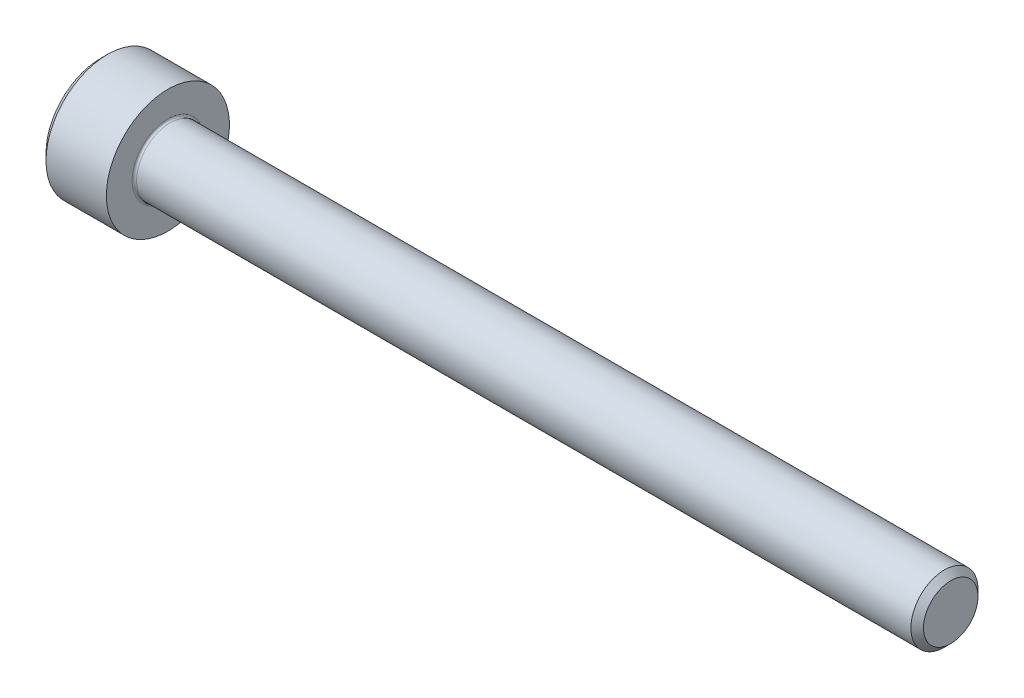
ISO-10303-21;
HEADER;
FILE_DESCRIPTION(('STEP AP214'),'2;1');
FILE_NAME('part.step','',(''),(''),'','','');
FILE_SCHEMA(('AUTOMOTIVE_DESIGN { 1 0 10303 214 1 1 1 1 }'));
ENDSEC;
DATA;
#1=APPLICATION_CONTEXT('core data for automotive mechanical design processes');
#2=APPLICATION_PROTOCOL_DEFINITION('international standard','automotive_design',2000,#1);
#3=PRODUCT_CONTEXT('',#1,'mechanical');
#4=PRODUCT('Part','Part','',(#3));
#5=PRODUCT_RELATED_PRODUCT_CATEGORY('part','',(#4));
#6=PRODUCT_DEFINITION_FORMATION('','',#4);
#7=PRODUCT_DEFINITION_CONTEXT('part definition',#1,'design');
#8=PRODUCT_DEFINITION('design','',#6,#7);
#9=PRODUCT_DEFINITION_SHAPE('','',#8);
#10=(LENGTH_UNIT() NAMED_UNIT(*) SI_UNIT(.MILLI.,.METRE.));
#11=(NAMED_UNIT(*) PLANE_ANGLE_UNIT() SI_UNIT($,.RADIAN.));
#12=(NAMED_UNIT(*) SI_UNIT($,.STERADIAN.) SOLID_ANGLE_UNIT());
#13=UNCERTAINTY_MEASURE_WITH_UNIT(LENGTH_MEASURE(1.E-05),#10,'distance_accuracy_value','');
#14=(GEOMETRIC_REPRESENTATION_CONTEXT(3) GLOBAL_UNCERTAINTY_ASSIGNED_CONTEXT((#13)) GLOBAL_UNIT_ASSIGNED_CONTEXT((#10,
#11,#12)) REPRESENTATION_CONTEXT('',''));
#15=CARTESIAN_POINT('',(0.,0.,0.));
#16=DIRECTION('',(0.,0.,1.));
#17=DIRECTION('',(1.,0.,0.));
#18=AXIS2_PLACEMENT_3D('',#15,#16,#17);
#19=CARTESIAN_POINT('',(0.,0.,0.));
#20=DIRECTION('',(-1.,0.,0.));
#21=DIRECTION('',(0.,0.,1.));
#22=AXIS2_PLACEMENT_3D('',#19,#20,#21);
#23=PLANE('',#22);
#24=DIRECTION('',(0.,-0.5,0.866025403784439));
#25=VECTOR('',#24,1.);
#26=CARTESIAN_POINT('',(0.,1.47801668912544,0.));
#27=LINE('',#26,#25);
#28=CARTESIAN_POINT('',(0.,1.47801668912544,0.));
#29=VERTEX_POINT('',#28);
#30=CARTESIAN_POINT('',(0.,0.739008344562719,1.28));
#31=VERTEX_POINT('',#30);
#32=EDGE_CURVE('E260',#29,#31,#27,.T.);
#33=ORIENTED_EDGE('',*,*,#32,.T.);
#34=DIRECTION('',(0.,1.,0.));
#35=VECTOR('',#34,1.);
#36=CARTESIAN_POINT('',(0.,-0.739008344562723,1.28));
#37=LINE('',#36,#35);
#38=CARTESIAN_POINT('',(0.,-0.739008344562723,1.28));
#39=VERTEX_POINT('',#38);
#40=EDGE_CURVE('E131',#39,#31,#37,.T.);
#41=ORIENTED_EDGE('',*,*,#40,.F.);
#42=DIRECTION('',(0.,-0.500000000000001,-0.866025403784438));
#43=VECTOR('',#42,1.);
#44=CARTESIAN_POINT('',(0.,-0.739008344562723,1.28));
#45=LINE('',#44,#43);
#46=CARTESIAN_POINT('',(0.,-1.47801668912545,0.));
#47=VERTEX_POINT('',#46);
#48=EDGE_CURVE('E263',#39,#47,#45,.T.);
#49=ORIENTED_EDGE('',*,*,#48,.T.);
#50=DIRECTION('',(0.,0.5,-0.866025403784439));
#51=VECTOR('',#50,1.);
#52=CARTESIAN_POINT('',(0.,-1.47801668912545,0.));
#53=LINE('',#52,#51);
#54=CARTESIAN_POINT('',(0.,-0.739008344562725,-1.28));
#55=VERTEX_POINT('',#54);
#56=EDGE_CURVE('E266',#47,#55,#53,.T.);
#57=ORIENTED_EDGE('',*,*,#56,.T.);
#58=DIRECTION('',(0.,-1.,0.));
#59=VECTOR('',#58,1.);
#60=CARTESIAN_POINT('',(0.,0.739008344562717,-1.28));
#61=LINE('',#60,#59);
#62=CARTESIAN_POINT('',(0.,0.739008344562717,-1.28));
#63=VERTEX_POINT('',#62);
#64=EDGE_CURVE('E269',#63,#55,#61,.T.);
#65=ORIENTED_EDGE('',*,*,#64,.F.);
#66=DIRECTION('',(0.,-0.500000000000001,-0.866025403784438));
#67=VECTOR('',#66,1.);
#68=CARTESIAN_POINT('',(0.,1.47801668912544,0.));
#69=LINE('',#68,#67);
#70=EDGE_CURVE('E126',#29,#63,#69,.T.);
#71=ORIENTED_EDGE('',*,*,#70,.F.);
#72=EDGE_LOOP('',(#33,#41,#49,#57,#65,#71));
#73=FACE_BOUND('',#72,.T.);
#74=CARTESIAN_POINT('',(0.,0.,0.));
#75=DIRECTION('',(-1.,0.,0.));
#76=DIRECTION('',(0.,0.,1.));
#77=AXIS2_PLACEMENT_3D('',#74,#75,#76);
#78=CIRCLE('',#77,2.45);
#79=CARTESIAN_POINT('',(0.,0.,2.45));
#80=VERTEX_POINT('',#79);
#81=EDGE_CURVE('E155',#80,#80,#78,.T.);
#82=ORIENTED_EDGE('',*,*,#81,.T.);
#83=EDGE_LOOP('',(#82));
#84=FACE_BOUND('',#83,.T.);
#85=ADVANCED_FACE('F35',(#73,#84),#23,.T.);
#86=CARTESIAN_POINT('',(0.,0.,0.));
#87=DIRECTION('',(1.,0.,0.));
#88=DIRECTION('',(0.,0.,-1.));
#89=AXIS2_PLACEMENT_3D('',#86,#87,#88);
#90=CONICAL_SURFACE('',#89,2.45,0.785398163397447);
#91=CARTESIAN_POINT('',(0.300000000000002,0.,0.));
#92=DIRECTION('',(-1.,0.,0.));
#93=DIRECTION('',(0.,0.,1.));
#94=AXIS2_PLACEMENT_3D('',#91,#92,#93);
#95=CIRCLE('',#94,2.75);
#96=CARTESIAN_POINT('',(0.300000000000002,0.,2.75));
#97=VERTEX_POINT('',#96);
#98=EDGE_CURVE('E152',#97,#97,#95,.T.);
#99=ORIENTED_EDGE('',*,*,#98,.T.);
#100=EDGE_LOOP('',(#99));
#101=FACE_BOUND('',#100,.T.);
#102=ORIENTED_EDGE('',*,*,#81,.F.);
#103=EDGE_LOOP('',(#102));
#104=FACE_BOUND('',#103,.T.);
#105=ADVANCED_FACE('F176',(#101,#104),#90,.T.);
#106=CARTESIAN_POINT('',(-31.75,0.,0.));
#107=DIRECTION('',(-1.,0.,0.));
#108=DIRECTION('',(0.,0.,1.));
#109=AXIS2_PLACEMENT_3D('',#106,#107,#108);
#110=CYLINDRICAL_SURFACE('',#109,2.75);
#111=CARTESIAN_POINT('',(3.,0.,0.));
#112=DIRECTION('',(-1.,0.,0.));
#113=DIRECTION('',(0.,0.,1.));
#114=AXIS2_PLACEMENT_3D('',#111,#112,#113);
#115=CIRCLE('',#114,2.75);
#116=CARTESIAN_POINT('',(3.,0.,2.75));
#117=VERTEX_POINT('',#116);
#118=EDGE_CURVE('E149',#117,#117,#115,.T.);
#119=ORIENTED_EDGE('',*,*,#118,.T.);
#120=EDGE_LOOP('',(#119));
#121=FACE_BOUND('',#120,.T.);
#122=ORIENTED_EDGE('',*,*,#98,.F.);
#123=EDGE_LOOP('',(#122));
#124=FACE_BOUND('',#123,.T.);
#125=ADVANCED_FACE('F181',(#121,#124),#110,.T.);
#126=CARTESIAN_POINT('',(3.,2.75,0.));
#127=DIRECTION('',(1.,0.,0.));
#128=DIRECTION('',(0.,0.,-1.));
#129=AXIS2_PLACEMENT_3D('',#126,#127,#128);
#130=PLANE('',#129);
#131=CARTESIAN_POINT('',(3.,0.,0.));
#132=DIRECTION('',(1.,0.,0.));
#133=DIRECTION('',(0.,0.,-1.));
#134=AXIS2_PLACEMENT_3D('',#131,#132,#133);
#135=CIRCLE('',#134,1.59999999999998);
#136=CARTESIAN_POINT('',(3.,0.,-1.59999999999998));
#137=VERTEX_POINT('',#136);
#138=EDGE_CURVE('E43',#137,#137,#135,.F.);
#139=ORIENTED_EDGE('',*,*,#138,.T.);
#140=EDGE_LOOP('',(#139));
#141=FACE_BOUND('',#140,.T.);
#142=ORIENTED_EDGE('',*,*,#118,.F.);
#143=EDGE_LOOP('',(#142));
#144=FACE_BOUND('',#143,.T.);
#145=ADVANCED_FACE('F160',(#141,#144),#130,.T.);
#146=CARTESIAN_POINT('',(-31.75,0.,0.));
#147=DIRECTION('',(-1.,0.,0.));
#148=DIRECTION('',(0.,0.,1.));
#149=AXIS2_PLACEMENT_3D('',#146,#147,#148);
#150=CYLINDRICAL_SURFACE('',#149,1.49999999999998);
#151=CARTESIAN_POINT('',(3.1,0.,0.));
#152=DIRECTION('',(1.,0.,0.));
#153=DIRECTION('',(0.,0.,-1.));
#154=AXIS2_PLACEMENT_3D('',#151,#152,#153);
#155=CIRCLE('',#154,1.49999999999998);
#156=CARTESIAN_POINT('',(3.1,0.,-1.49999999999998));
#157=VERTEX_POINT('',#156);
#158=EDGE_CURVE('E11',#157,#157,#155,.T.);
#159=ORIENTED_EDGE('',*,*,#158,.T.);
#160=EDGE_LOOP('',(#159));
#161=FACE_BOUND('',#160,.T.);
#162=CARTESIAN_POINT('',(37.7195,0.,0.));
#163=DIRECTION('',(-1.,0.,0.));
#164=DIRECTION('',(0.,0.,1.));
#165=AXIS2_PLACEMENT_3D('',#162,#163,#164);
#166=CIRCLE('',#165,1.49999999999996);
#167=CARTESIAN_POINT('',(37.7195,0.,1.49999999999996));
#168=VERTEX_POINT('',#167);
#169=EDGE_CURVE('E146',#168,#168,#166,.T.);
#170=ORIENTED_EDGE('',*,*,#169,.T.);
#171=EDGE_LOOP('',(#170));
#172=FACE_BOUND('',#171,.T.);
#173=ADVANCED_FACE('F191',(#161,#172),#150,.T.);
#174=CARTESIAN_POINT('',(38.,0.,0.));
#175=DIRECTION('',(-1.,0.,0.));
#176=DIRECTION('',(0.,0.,1.));
#177=AXIS2_PLACEMENT_3D('',#174,#175,#176);
#178=CONICAL_SURFACE('',#177,1.2195,0.785398163397317);
#179=ORIENTED_EDGE('',*,*,#169,.F.);
#180=EDGE_LOOP('',(#179));
#181=FACE_BOUND('',#180,.T.);
#182=CARTESIAN_POINT('',(38.,0.,0.));
#183=DIRECTION('',(-1.,0.,0.));
#184=DIRECTION('',(0.,0.,1.));
#185=AXIS2_PLACEMENT_3D('',#182,#183,#184);
#186=CIRCLE('',#185,1.2195);
#187=CARTESIAN_POINT('',(38.,0.,1.2195));
#188=VERTEX_POINT('',#187);
#189=EDGE_CURVE('E142',#188,#188,#186,.T.);
#190=ORIENTED_EDGE('',*,*,#189,.T.);
#191=EDGE_LOOP('',(#190));
#192=FACE_BOUND('',#191,.T.);
#193=ADVANCED_FACE('F171',(#181,#192),#178,.T.);
#194=CARTESIAN_POINT('',(38.,1.2195,0.));
#195=DIRECTION('',(1.,0.,0.));
#196=DIRECTION('',(0.,0.,-1.));
#197=AXIS2_PLACEMENT_3D('',#194,#195,#196);
#198=PLANE('',#197);
#199=ORIENTED_EDGE('',*,*,#189,.F.);
#200=EDGE_LOOP('',(#199));
#201=FACE_BOUND('',#200,.T.);
#202=ADVANCED_FACE('F164',(#201),#198,.T.);
#203=CARTESIAN_POINT('',(3.1,0.,0.));
#204=DIRECTION('',(1.,0.,0.));
#205=DIRECTION('',(0.,0.,-1.));
#206=AXIS2_PLACEMENT_3D('',#203,#204,#205);
#207=TOROIDAL_SURFACE('',#206,1.59999999999998,0.1);
#208=ORIENTED_EDGE('',*,*,#158,.F.);
#209=EDGE_LOOP('',(#208));
#210=FACE_BOUND('',#209,.T.);
#211=ORIENTED_EDGE('',*,*,#138,.F.);
#212=EDGE_LOOP('',(#211));
#213=FACE_BOUND('',#212,.T.);
#214=ADVANCED_FACE('F37',(#210,#213),#207,.F.);
#215=CARTESIAN_POINT('',(1.3,1.47801668912544,0.));
#216=DIRECTION('',(0.,-0.866025403784439,-0.5));
#217=DIRECTION('',(0.,0.5,-0.866025403784439));
#218=AXIS2_PLACEMENT_3D('',#215,#216,#217);
#219=PLANE('',#218);
#220=ORIENTED_EDGE('',*,*,#32,.F.);
#221=DIRECTION('',(-1.,0.,0.));
#222=VECTOR('',#221,1.);
#223=CARTESIAN_POINT('',(1.3,1.47801668912544,0.));
#224=LINE('',#223,#222);
#225=CARTESIAN_POINT('',(1.3,1.47801668912544,0.));
#226=VERTEX_POINT('',#225);
#227=EDGE_CURVE('E250',#226,#29,#224,.T.);
#228=ORIENTED_EDGE('',*,*,#227,.F.);
#229=DIRECTION('',(0.,-0.5,0.866025403784439));
#230=VECTOR('',#229,1.);
#231=CARTESIAN_POINT('',(1.3,1.47801668912544,0.));
#232=LINE('',#231,#230);
#233=CARTESIAN_POINT('',(1.3,1.10851251684408,0.639999999999998));
#234=VERTEX_POINT('',#233);
#235=EDGE_CURVE('E118',#226,#234,#232,.T.);
#236=ORIENTED_EDGE('',*,*,#235,.T.);
#237=CARTESIAN_POINT('',(1.3,0.739008344562719,1.28));
#238=VERTEX_POINT('',#237);
#239=EDGE_CURVE('E109',#234,#238,#232,.T.);
#240=ORIENTED_EDGE('',*,*,#239,.T.);
#241=DIRECTION('',(-1.,0.,0.));
#242=VECTOR('',#241,1.);
#243=CARTESIAN_POINT('',(1.3,0.739008344562719,1.28));
#244=LINE('',#243,#242);
#245=EDGE_CURVE('E123',#238,#31,#244,.T.);
#246=ORIENTED_EDGE('',*,*,#245,.T.);
#247=EDGE_LOOP('',(#220,#228,#236,#240,#246));
#248=FACE_BOUND('',#247,.T.);
#249=ADVANCED_FACE('F122',(#248),#219,.T.);
#250=CARTESIAN_POINT('',(1.3,-0.739008344562723,1.28));
#251=DIRECTION('',(0.,0.,1.));
#252=DIRECTION('',(0.,-1.,0.));
#253=AXIS2_PLACEMENT_3D('',#250,#251,#252);
#254=PLANE('',#253);
#255=ORIENTED_EDGE('',*,*,#40,.T.);
#256=ORIENTED_EDGE('',*,*,#245,.F.);
#257=DIRECTION('',(0.,1.,0.));
#258=VECTOR('',#257,1.);
#259=CARTESIAN_POINT('',(1.3,-0.739008344562723,1.28));
#260=LINE('',#259,#258);
#261=CARTESIAN_POINT('',(1.3,0.,1.28));
#262=VERTEX_POINT('',#261);
#263=EDGE_CURVE('E106',#262,#238,#260,.T.);
#264=ORIENTED_EDGE('',*,*,#263,.F.);
#265=CARTESIAN_POINT('',(1.3,-0.739008344562723,1.28));
#266=VERTEX_POINT('',#265);
#267=EDGE_CURVE('E117',#266,#262,#260,.T.);
#268=ORIENTED_EDGE('',*,*,#267,.F.);
#269=DIRECTION('',(-1.,0.,0.));
#270=VECTOR('',#269,1.);
#271=CARTESIAN_POINT('',(1.3,-0.739008344562723,1.28));
#272=LINE('',#271,#270);
#273=EDGE_CURVE('E133',#266,#39,#272,.T.);
#274=ORIENTED_EDGE('',*,*,#273,.T.);
#275=EDGE_LOOP('',(#255,#256,#264,#268,#274));
#276=FACE_BOUND('',#275,.T.);
#277=ADVANCED_FACE('F128',(#276),#254,.F.);
#278=CARTESIAN_POINT('',(1.3,-0.739008344562723,1.28));
#279=DIRECTION('',(0.,0.866025403784438,-0.500000000000001));
#280=DIRECTION('',(0.,0.500000000000001,0.866025403784438));
#281=AXIS2_PLACEMENT_3D('',#278,#279,#280);
#282=PLANE('',#281);
#283=ORIENTED_EDGE('',*,*,#48,.F.);
#284=ORIENTED_EDGE('',*,*,#273,.F.);
#285=DIRECTION('',(0.,-0.500000000000001,-0.866025403784438));
#286=VECTOR('',#285,1.);
#287=CARTESIAN_POINT('',(1.3,-0.739008344562723,1.28));
#288=LINE('',#287,#286);
#289=CARTESIAN_POINT('',(1.3,-1.10851251684408,0.640000000000003));
#290=VERTEX_POINT('',#289);
#291=EDGE_CURVE('E289',#266,#290,#288,.T.);
#292=ORIENTED_EDGE('',*,*,#291,.T.);
#293=CARTESIAN_POINT('',(1.3,-1.47801668912545,0.));
#294=VERTEX_POINT('',#293);
#295=EDGE_CURVE('E278',#290,#294,#288,.T.);
#296=ORIENTED_EDGE('',*,*,#295,.T.);
#297=DIRECTION('',(-1.,0.,0.));
#298=VECTOR('',#297,1.);
#299=CARTESIAN_POINT('',(1.3,-1.47801668912545,0.));
#300=LINE('',#299,#298);
#301=EDGE_CURVE('E138',#294,#47,#300,.T.);
#302=ORIENTED_EDGE('',*,*,#301,.T.);
#303=EDGE_LOOP('',(#283,#284,#292,#296,#302));
#304=FACE_BOUND('',#303,.T.);
#305=ADVANCED_FACE('F204',(#304),#282,.T.);
#306=CARTESIAN_POINT('',(1.3,-1.47801668912545,0.));
#307=DIRECTION('',(0.,0.866025403784439,0.5));
#308=DIRECTION('',(0.,-0.5,0.866025403784439));
#309=AXIS2_PLACEMENT_3D('',#306,#307,#308);
#310=PLANE('',#309);
#311=ORIENTED_EDGE('',*,*,#56,.F.);
#312=ORIENTED_EDGE('',*,*,#301,.F.);
#313=DIRECTION('',(0.,0.5,-0.866025403784439));
#314=VECTOR('',#313,1.);
#315=CARTESIAN_POINT('',(1.3,-1.47801668912545,0.));
#316=LINE('',#315,#314);
#317=CARTESIAN_POINT('',(1.3,-1.10851251684409,-0.640000000000002));
#318=VERTEX_POINT('',#317);
#319=EDGE_CURVE('E256',#294,#318,#316,.T.);
#320=ORIENTED_EDGE('',*,*,#319,.T.);
#321=CARTESIAN_POINT('',(1.3,-0.739008344562725,-1.28));
#322=VERTEX_POINT('',#321);
#323=EDGE_CURVE('E288',#318,#322,#316,.T.);
#324=ORIENTED_EDGE('',*,*,#323,.T.);
#325=DIRECTION('',(-1.,0.,0.));
#326=VECTOR('',#325,1.);
#327=CARTESIAN_POINT('',(1.3,-0.739008344562725,-1.28));
#328=LINE('',#327,#326);
#329=EDGE_CURVE('E249',#322,#55,#328,.T.);
#330=ORIENTED_EDGE('',*,*,#329,.T.);
#331=EDGE_LOOP('',(#311,#312,#320,#324,#330));
#332=FACE_BOUND('',#331,.T.);
#333=ADVANCED_FACE('F207',(#332),#310,.T.);
#334=CARTESIAN_POINT('',(1.3,0.739008344562717,-1.28));
#335=DIRECTION('',(0.,0.,-1.));
#336=DIRECTION('',(0.,1.,0.));
#337=AXIS2_PLACEMENT_3D('',#334,#335,#336);
#338=PLANE('',#337);
#339=ORIENTED_EDGE('',*,*,#64,.T.);
#340=ORIENTED_EDGE('',*,*,#329,.F.);
#341=DIRECTION('',(0.,-1.,0.));
#342=VECTOR('',#341,1.);
#343=CARTESIAN_POINT('',(1.3,0.739008344562717,-1.28));
#344=LINE('',#343,#342);
#345=CARTESIAN_POINT('',(1.3,0.,-1.28));
#346=VERTEX_POINT('',#345);
#347=EDGE_CURVE('E253',#346,#322,#344,.T.);
#348=ORIENTED_EDGE('',*,*,#347,.F.);
#349=CARTESIAN_POINT('',(1.3,0.739008344562717,-1.28));
#350=VERTEX_POINT('',#349);
#351=EDGE_CURVE('E50',#350,#346,#344,.T.);
#352=ORIENTED_EDGE('',*,*,#351,.F.);
#353=DIRECTION('',(-1.,0.,0.));
#354=VECTOR('',#353,1.);
#355=CARTESIAN_POINT('',(1.3,0.739008344562717,-1.28));
#356=LINE('',#355,#354);
#357=EDGE_CURVE('E246',#350,#63,#356,.T.);
#358=ORIENTED_EDGE('',*,*,#357,.T.);
#359=EDGE_LOOP('',(#339,#340,#348,#352,#358));
#360=FACE_BOUND('',#359,.T.);
#361=ADVANCED_FACE('F211',(#360),#338,.F.);
#362=CARTESIAN_POINT('',(1.3,1.47801668912544,0.));
#363=DIRECTION('',(0.,0.866025403784438,-0.500000000000001));
#364=DIRECTION('',(0.,0.500000000000001,0.866025403784438));
#365=AXIS2_PLACEMENT_3D('',#362,#363,#364);
#366=PLANE('',#365);
#367=ORIENTED_EDGE('',*,*,#70,.T.);
#368=ORIENTED_EDGE('',*,*,#357,.F.);
#369=DIRECTION('',(0.,-0.500000000000001,-0.866025403784438));
#370=VECTOR('',#369,1.);
#371=CARTESIAN_POINT('',(1.3,1.47801668912544,0.));
#372=LINE('',#371,#370);
#373=CARTESIAN_POINT('',(1.3,1.10851251684408,-0.640000000000001));
#374=VERTEX_POINT('',#373);
#375=EDGE_CURVE('E236',#374,#350,#372,.T.);
#376=ORIENTED_EDGE('',*,*,#375,.F.);
#377=EDGE_CURVE('E242',#226,#374,#372,.T.);
#378=ORIENTED_EDGE('',*,*,#377,.F.);
#379=ORIENTED_EDGE('',*,*,#227,.T.);
#380=EDGE_LOOP('',(#367,#368,#376,#378,#379));
#381=FACE_BOUND('',#380,.T.);
#382=ADVANCED_FACE('F215',(#381),#366,.F.);
#383=CARTESIAN_POINT('',(1.3,1.47801668912544,0.));
#384=DIRECTION('',(1.,0.,0.));
#385=DIRECTION('',(0.,0.,-1.));
#386=AXIS2_PLACEMENT_3D('',#383,#384,#385);
#387=PLANE('',#386);
#388=ORIENTED_EDGE('',*,*,#347,.T.);
#389=ORIENTED_EDGE('',*,*,#323,.F.);
#390=CARTESIAN_POINT('',(1.3,0.,0.));
#391=DIRECTION('',(-1.,0.,0.));
#392=DIRECTION('',(0.,0.,1.));
#393=AXIS2_PLACEMENT_3D('',#390,#391,#392);
#394=CIRCLE('',#393,1.28);
#395=EDGE_CURVE('E284',#346,#318,#394,.T.);
#396=ORIENTED_EDGE('',*,*,#395,.F.);
#397=EDGE_LOOP('',(#388,#389,#396));
#398=FACE_BOUND('',#397,.T.);
#399=ADVANCED_FACE('F219',(#398),#387,.F.);
#400=ORIENTED_EDGE('',*,*,#319,.F.);
#401=ORIENTED_EDGE('',*,*,#295,.F.);
#402=EDGE_CURVE('E136',#318,#290,#394,.T.);
#403=ORIENTED_EDGE('',*,*,#402,.F.);
#404=EDGE_LOOP('',(#400,#401,#403));
#405=FACE_BOUND('',#404,.T.);
#406=ADVANCED_FACE('F222',(#405),#387,.F.);
#407=ORIENTED_EDGE('',*,*,#291,.F.);
#408=ORIENTED_EDGE('',*,*,#267,.T.);
#409=EDGE_CURVE('E132',#290,#262,#394,.T.);
#410=ORIENTED_EDGE('',*,*,#409,.F.);
#411=EDGE_LOOP('',(#407,#408,#410));
#412=FACE_BOUND('',#411,.T.);
#413=ADVANCED_FACE('F227',(#412),#387,.F.);
#414=ORIENTED_EDGE('',*,*,#263,.T.);
#415=ORIENTED_EDGE('',*,*,#239,.F.);
#416=EDGE_CURVE('E112',#262,#234,#394,.T.);
#417=ORIENTED_EDGE('',*,*,#416,.F.);
#418=EDGE_LOOP('',(#414,#415,#417));
#419=FACE_BOUND('',#418,.T.);
#420=ADVANCED_FACE('F108',(#419),#387,.F.);
#421=ORIENTED_EDGE('',*,*,#235,.F.);
#422=ORIENTED_EDGE('',*,*,#377,.T.);
#423=EDGE_CURVE('E143',#234,#374,#394,.T.);
#424=ORIENTED_EDGE('',*,*,#423,.F.);
#425=EDGE_LOOP('',(#421,#422,#424));
#426=FACE_BOUND('',#425,.T.);
#427=ADVANCED_FACE('F230',(#426),#387,.F.);
#428=ORIENTED_EDGE('',*,*,#375,.T.);
#429=ORIENTED_EDGE('',*,*,#351,.T.);
#430=EDGE_CURVE('E239',#374,#346,#394,.T.);
#431=ORIENTED_EDGE('',*,*,#430,.F.);
#432=EDGE_LOOP('',(#428,#429,#431));
#433=FACE_BOUND('',#432,.T.);
#434=ADVANCED_FACE('F200',(#433),#387,.F.);
#435=CARTESIAN_POINT('',(1.3,0.,0.));
#436=DIRECTION('',(-1.,0.,0.));
#437=DIRECTION('',(0.,0.,1.));
#438=AXIS2_PLACEMENT_3D('',#435,#436,#437);
#439=CONICAL_SURFACE('',#438,1.28,1.0471975511966);
#440=CARTESIAN_POINT('',(2.03900834456273,0.,0.));
#441=VERTEX_POINT('',#440);
#442=VERTEX_LOOP('',#441);
#443=FACE_BOUND('',#442,.T.);
#444=ORIENTED_EDGE('',*,*,#416,.T.);
#445=ORIENTED_EDGE('',*,*,#423,.T.);
#446=ORIENTED_EDGE('',*,*,#430,.T.);
#447=ORIENTED_EDGE('',*,*,#395,.T.);
#448=ORIENTED_EDGE('',*,*,#402,.T.);
#449=ORIENTED_EDGE('',*,*,#409,.T.);
#450=EDGE_LOOP('',(#444,#445,#446,#447,#448,#449));
#451=FACE_BOUND('',#450,.T.);
#452=ADVANCED_FACE('F198',(#443,#451),#439,.F.);
#453=CLOSED_SHELL('',(#85,#105,#125,#145,#173,#193,#202,#214,#249,#277,#305,#333,#361,#382,#399,
#406,#413,#420,#427,#434,#452));
#454=MANIFOLD_SOLID_BREP('B2',#453);
#455=ADVANCED_BREP_SHAPE_REPRESENTATION('',(#18,#454),#14);
#456=SHAPE_DEFINITION_REPRESENTATION(#9,#455);
ENDSEC;
END-ISO-10303-21;
